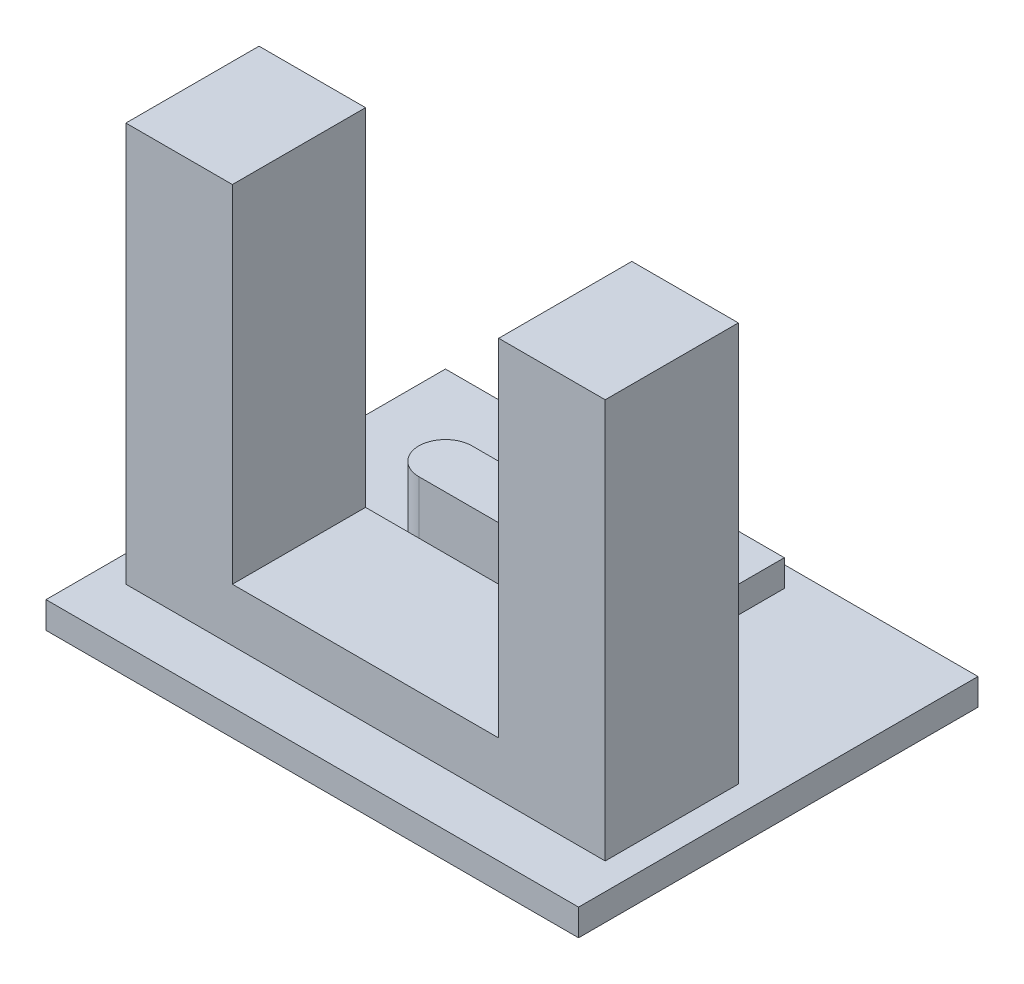
ISO-10303-21;
HEADER;
FILE_DESCRIPTION(('STEP AP214'),'2;1');
FILE_NAME('part.step','',(''),(''),'','','');
FILE_SCHEMA(('AUTOMOTIVE_DESIGN { 1 0 10303 214 1 1 1 1 }'));
ENDSEC;
DATA;
#1=APPLICATION_CONTEXT('core data for automotive mechanical design processes');
#2=APPLICATION_PROTOCOL_DEFINITION('international standard','automotive_design',2000,#1);
#3=PRODUCT_CONTEXT('',#1,'mechanical');
#4=PRODUCT('Part','Part','',(#3));
#5=PRODUCT_RELATED_PRODUCT_CATEGORY('part','',(#4));
#6=PRODUCT_DEFINITION_FORMATION('','',#4);
#7=PRODUCT_DEFINITION_CONTEXT('part definition',#1,'design');
#8=PRODUCT_DEFINITION('design','',#6,#7);
#9=PRODUCT_DEFINITION_SHAPE('','',#8);
#10=(LENGTH_UNIT() NAMED_UNIT(*) SI_UNIT(.MILLI.,.METRE.));
#11=(NAMED_UNIT(*) PLANE_ANGLE_UNIT() SI_UNIT($,.RADIAN.));
#12=(NAMED_UNIT(*) SI_UNIT($,.STERADIAN.) SOLID_ANGLE_UNIT());
#13=UNCERTAINTY_MEASURE_WITH_UNIT(LENGTH_MEASURE(1.E-05),#10,'distance_accuracy_value','');
#14=(GEOMETRIC_REPRESENTATION_CONTEXT(3) GLOBAL_UNCERTAINTY_ASSIGNED_CONTEXT((#13)) GLOBAL_UNIT_ASSIGNED_CONTEXT((#10,
#11,#12)) REPRESENTATION_CONTEXT('',''));
#15=CARTESIAN_POINT('',(0.,0.,0.));
#16=DIRECTION('',(0.,0.,1.));
#17=DIRECTION('',(1.,0.,0.));
#18=AXIS2_PLACEMENT_3D('',#15,#16,#17);
#19=CARTESIAN_POINT('',(0.,0.,0.));
#20=DIRECTION('',(0.,1.,0.));
#21=DIRECTION('',(0.,0.,1.));
#22=AXIS2_PLACEMENT_3D('',#19,#20,#21);
#23=PLANE('',#22);
#24=DIRECTION('',(0.,0.,1.));
#25=VECTOR('',#24,1.);
#26=CARTESIAN_POINT('',(-19.9031908774488,0.,0.));
#27=LINE('',#26,#25);
#28=CARTESIAN_POINT('',(-19.9031908774488,0.,-23.1784593066955));
#29=VERTEX_POINT('',#28);
#30=CARTESIAN_POINT('',(-19.9031908774488,0.,-8.1784593066955));
#31=VERTEX_POINT('',#30);
#32=EDGE_CURVE('E400',#29,#31,#27,.T.);
#33=ORIENTED_EDGE('',*,*,#32,.F.);
#34=DIRECTION('',(1.,0.,0.));
#35=VECTOR('',#34,1.);
#36=CARTESIAN_POINT('',(0.,0.,-23.1784593066955));
#37=LINE('',#36,#35);
#38=CARTESIAN_POINT('',(-39.9031908774488,0.,-23.1784593066955));
#39=VERTEX_POINT('',#38);
#40=EDGE_CURVE('E417',#39,#29,#37,.T.);
#41=ORIENTED_EDGE('',*,*,#40,.F.);
#42=DIRECTION('',(0.,0.,1.));
#43=VECTOR('',#42,1.);
#44=CARTESIAN_POINT('',(-39.9031908774488,0.,0.));
#45=LINE('',#44,#43);
#46=CARTESIAN_POINT('',(-39.9031908774488,0.,-8.1784593066955));
#47=VERTEX_POINT('',#46);
#48=EDGE_CURVE('E419',#39,#47,#45,.T.);
#49=ORIENTED_EDGE('',*,*,#48,.T.);
#50=DIRECTION('',(1.,0.,0.));
#51=VECTOR('',#50,1.);
#52=CARTESIAN_POINT('',(0.,0.,-8.1784593066955));
#53=LINE('',#52,#51);
#54=EDGE_CURVE('E406',#47,#31,#53,.T.);
#55=ORIENTED_EDGE('',*,*,#54,.T.);
#56=EDGE_LOOP('',(#33,#41,#49,#55));
#57=FACE_BOUND('',#56,.T.);
#58=DIRECTION('',(1.,0.,0.));
#59=VECTOR('',#58,1.);
#60=CARTESIAN_POINT('',(0.,0.,-15.1784593066955));
#61=LINE('',#60,#59);
#62=CARTESIAN_POINT('',(-38.9031908774488,0.,-15.1784593066955));
#63=VERTEX_POINT('',#62);
#64=CARTESIAN_POINT('',(-20.9031908774488,0.,-15.1784593066955));
#65=VERTEX_POINT('',#64);
#66=EDGE_CURVE('E387',#63,#65,#61,.T.);
#67=ORIENTED_EDGE('',*,*,#66,.T.);
#68=DIRECTION('',(0.,0.,1.));
#69=VECTOR('',#68,1.);
#70=CARTESIAN_POINT('',(-20.9031908774488,0.,0.));
#71=LINE('',#70,#69);
#72=CARTESIAN_POINT('',(-20.9031908774488,0.,-10.1784593066955));
#73=VERTEX_POINT('',#72);
#74=EDGE_CURVE('E337',#65,#73,#71,.T.);
#75=ORIENTED_EDGE('',*,*,#74,.T.);
#76=DIRECTION('',(1.,0.,0.));
#77=VECTOR('',#76,1.);
#78=CARTESIAN_POINT('',(0.,0.,-10.1784593066955));
#79=LINE('',#78,#77);
#80=CARTESIAN_POINT('',(-38.9031908774488,0.,-10.1784593066955));
#81=VERTEX_POINT('',#80);
#82=EDGE_CURVE('E392',#81,#73,#79,.T.);
#83=ORIENTED_EDGE('',*,*,#82,.F.);
#84=DIRECTION('',(0.,0.,1.));
#85=VECTOR('',#84,1.);
#86=CARTESIAN_POINT('',(-38.9031908774488,0.,0.));
#87=LINE('',#86,#85);
#88=EDGE_CURVE('E362',#63,#81,#87,.T.);
#89=ORIENTED_EDGE('',*,*,#88,.F.);
#90=EDGE_LOOP('',(#67,#75,#83,#89));
#91=FACE_BOUND('',#90,.T.);
#92=CARTESIAN_POINT('',(-25.9031908774488,0.,-17.1784593066955));
#93=DIRECTION('',(0.,1.,0.));
#94=DIRECTION('',(0.,0.,1.));
#95=AXIS2_PLACEMENT_3D('',#92,#93,#94);
#96=CIRCLE('',#95,1.);
#97=CARTESIAN_POINT('',(-25.9031908774488,0.,-18.1784593066955));
#98=VERTEX_POINT('',#97);
#99=CARTESIAN_POINT('',(-25.9031908774488,0.,-16.1784593066955));
#100=VERTEX_POINT('',#99);
#101=EDGE_CURVE('E305',#98,#100,#96,.F.);
#102=ORIENTED_EDGE('',*,*,#101,.T.);
#103=DIRECTION('',(-1.,0.,0.));
#104=VECTOR('',#103,1.);
#105=CARTESIAN_POINT('',(0.,0.,-16.1784593066955));
#106=LINE('',#105,#104);
#107=CARTESIAN_POINT('',(-33.9031908774488,0.,-16.1784593066955));
#108=VERTEX_POINT('',#107);
#109=EDGE_CURVE('E310',#100,#108,#106,.T.);
#110=ORIENTED_EDGE('',*,*,#109,.T.);
#111=CARTESIAN_POINT('',(-33.9031908774488,0.,-17.1784593066955));
#112=DIRECTION('',(0.,1.,0.));
#113=DIRECTION('',(0.,0.,1.));
#114=AXIS2_PLACEMENT_3D('',#111,#112,#113);
#115=CIRCLE('',#114,1.);
#116=CARTESIAN_POINT('',(-33.9031908774488,0.,-18.1784593066955));
#117=VERTEX_POINT('',#116);
#118=EDGE_CURVE('E322',#117,#108,#115,.T.);
#119=ORIENTED_EDGE('',*,*,#118,.F.);
#120=DIRECTION('',(1.,0.,0.));
#121=VECTOR('',#120,1.);
#122=CARTESIAN_POINT('',(0.,0.,-18.1784593066955));
#123=LINE('',#122,#121);
#124=EDGE_CURVE('E320',#117,#98,#123,.T.);
#125=ORIENTED_EDGE('',*,*,#124,.T.);
#126=EDGE_LOOP('',(#102,#110,#119,#125));
#127=FACE_BOUND('',#126,.T.);
#128=DIRECTION('',(1.,0.,0.));
#129=VECTOR('',#128,1.);
#130=CARTESIAN_POINT('',(0.,0.,-22.4055591876345));
#131=LINE('',#130,#129);
#132=CARTESIAN_POINT('',(-33.4031908774488,0.,-22.4055591876345));
#133=VERTEX_POINT('',#132);
#134=CARTESIAN_POINT('',(-26.4031908774488,0.,-22.4055591876345));
#135=VERTEX_POINT('',#134);
#136=EDGE_CURVE('E280',#133,#135,#131,.T.);
#137=ORIENTED_EDGE('',*,*,#136,.T.);
#138=DIRECTION('',(0.,0.,1.));
#139=VECTOR('',#138,1.);
#140=CARTESIAN_POINT('',(-26.4031908774488,0.,0.));
#141=LINE('',#140,#139);
#142=CARTESIAN_POINT('',(-26.4031908774488,0.,-20.4055591876345));
#143=VERTEX_POINT('',#142);
#144=EDGE_CURVE('E243',#135,#143,#141,.T.);
#145=ORIENTED_EDGE('',*,*,#144,.T.);
#146=DIRECTION('',(1.,0.,0.));
#147=VECTOR('',#146,1.);
#148=CARTESIAN_POINT('',(0.,0.,-20.4055591876345));
#149=LINE('',#148,#147);
#150=CARTESIAN_POINT('',(-33.4031908774488,0.,-20.4055591876345));
#151=VERTEX_POINT('',#150);
#152=EDGE_CURVE('E302',#151,#143,#149,.T.);
#153=ORIENTED_EDGE('',*,*,#152,.F.);
#154=DIRECTION('',(0.,0.,1.));
#155=VECTOR('',#154,1.);
#156=CARTESIAN_POINT('',(-33.4031908774488,0.,0.));
#157=LINE('',#156,#155);
#158=EDGE_CURVE('E300',#133,#151,#157,.T.);
#159=ORIENTED_EDGE('',*,*,#158,.F.);
#160=EDGE_LOOP('',(#137,#145,#153,#159));
#161=FACE_BOUND('',#160,.T.);
#162=ADVANCED_FACE('F80',(#57,#91,#127,#161),#23,.T.);
#163=CARTESIAN_POINT('',(0.,-1.,0.));
#164=DIRECTION('',(0.,1.,0.));
#165=DIRECTION('',(0.,0.,1.));
#166=AXIS2_PLACEMENT_3D('',#163,#164,#165);
#167=PLANE('',#166);
#168=DIRECTION('',(0.,0.,1.));
#169=VECTOR('',#168,1.);
#170=CARTESIAN_POINT('',(-19.9031908774488,-1.,0.));
#171=LINE('',#170,#169);
#172=CARTESIAN_POINT('',(-19.9031908774488,-1.,-23.1784593066955));
#173=VERTEX_POINT('',#172);
#174=CARTESIAN_POINT('',(-19.9031908774488,-1.,-8.1784593066955));
#175=VERTEX_POINT('',#174);
#176=EDGE_CURVE('E403',#173,#175,#171,.T.);
#177=ORIENTED_EDGE('',*,*,#176,.T.);
#178=DIRECTION('',(1.,0.,0.));
#179=VECTOR('',#178,1.);
#180=CARTESIAN_POINT('',(0.,-1.,-8.1784593066955));
#181=LINE('',#180,#179);
#182=CARTESIAN_POINT('',(-39.9031908774488,-1.,-8.1784593066955));
#183=VERTEX_POINT('',#182);
#184=EDGE_CURVE('E411',#183,#175,#181,.T.);
#185=ORIENTED_EDGE('',*,*,#184,.F.);
#186=DIRECTION('',(0.,0.,1.));
#187=VECTOR('',#186,1.);
#188=CARTESIAN_POINT('',(-39.9031908774488,-1.,0.));
#189=LINE('',#188,#187);
#190=CARTESIAN_POINT('',(-39.9031908774488,-1.,-23.1784593066955));
#191=VERTEX_POINT('',#190);
#192=EDGE_CURVE('E408',#191,#183,#189,.T.);
#193=ORIENTED_EDGE('',*,*,#192,.F.);
#194=DIRECTION('',(1.,0.,0.));
#195=VECTOR('',#194,1.);
#196=CARTESIAN_POINT('',(0.,-1.,-23.1784593066955));
#197=LINE('',#196,#195);
#198=EDGE_CURVE('E405',#191,#173,#197,.T.);
#199=ORIENTED_EDGE('',*,*,#198,.T.);
#200=EDGE_LOOP('',(#177,#185,#193,#199));
#201=FACE_BOUND('',#200,.T.);
#202=DIRECTION('',(0.,0.,1.));
#203=VECTOR('',#202,1.);
#204=CARTESIAN_POINT('',(-26.4031908774488,-1.,0.));
#205=LINE('',#204,#203);
#206=CARTESIAN_POINT('',(-26.4031908774488,-1.,-22.4055591876345));
#207=VERTEX_POINT('',#206);
#208=CARTESIAN_POINT('',(-26.4031908774488,-1.,-20.4055591876345));
#209=VERTEX_POINT('',#208);
#210=EDGE_CURVE('E12',#207,#209,#205,.T.);
#211=ORIENTED_EDGE('',*,*,#210,.F.);
#212=DIRECTION('',(1.,0.,0.));
#213=VECTOR('',#212,1.);
#214=CARTESIAN_POINT('',(0.,-1.,-22.4055591876345));
#215=LINE('',#214,#213);
#216=CARTESIAN_POINT('',(-33.4031908774488,-1.,-22.4055591876345));
#217=VERTEX_POINT('',#216);
#218=EDGE_CURVE('E426',#217,#207,#215,.T.);
#219=ORIENTED_EDGE('',*,*,#218,.F.);
#220=DIRECTION('',(0.,0.,1.));
#221=VECTOR('',#220,1.);
#222=CARTESIAN_POINT('',(-33.4031908774488,-1.,0.));
#223=LINE('',#222,#221);
#224=CARTESIAN_POINT('',(-33.4031908774488,-1.,-20.4055591876345));
#225=VERTEX_POINT('',#224);
#226=EDGE_CURVE('E435',#217,#225,#223,.T.);
#227=ORIENTED_EDGE('',*,*,#226,.T.);
#228=DIRECTION('',(1.,0.,0.));
#229=VECTOR('',#228,1.);
#230=CARTESIAN_POINT('',(0.,-1.,-20.4055591876345));
#231=LINE('',#230,#229);
#232=EDGE_CURVE('E88',#225,#209,#231,.T.);
#233=ORIENTED_EDGE('',*,*,#232,.T.);
#234=EDGE_LOOP('',(#211,#219,#227,#233));
#235=FACE_BOUND('',#234,.T.);
#236=ADVANCED_FACE('F437',(#201,#235),#167,.F.);
#237=CARTESIAN_POINT('',(0.,-1.,-8.1784593066955));
#238=DIRECTION('',(0.,0.,1.));
#239=DIRECTION('',(1.,0.,0.));
#240=AXIS2_PLACEMENT_3D('',#237,#238,#239);
#241=PLANE('',#240);
#242=ORIENTED_EDGE('',*,*,#54,.F.);
#243=DIRECTION('',(0.,1.,0.));
#244=VECTOR('',#243,1.);
#245=CARTESIAN_POINT('',(-39.9031908774488,-1.,-8.1784593066955));
#246=LINE('',#245,#244);
#247=EDGE_CURVE('E427',#183,#47,#246,.T.);
#248=ORIENTED_EDGE('',*,*,#247,.F.);
#249=ORIENTED_EDGE('',*,*,#184,.T.);
#250=DIRECTION('',(0.,1.,0.));
#251=VECTOR('',#250,1.);
#252=CARTESIAN_POINT('',(-19.9031908774488,-1.,-8.1784593066955));
#253=LINE('',#252,#251);
#254=EDGE_CURVE('E424',#175,#31,#253,.T.);
#255=ORIENTED_EDGE('',*,*,#254,.T.);
#256=EDGE_LOOP('',(#242,#248,#249,#255));
#257=FACE_BOUND('',#256,.T.);
#258=ADVANCED_FACE('F476',(#257),#241,.T.);
#259=CARTESIAN_POINT('',(-39.9031908774488,-1.,0.));
#260=DIRECTION('',(-1.,0.,0.));
#261=DIRECTION('',(0.,0.,1.));
#262=AXIS2_PLACEMENT_3D('',#259,#260,#261);
#263=PLANE('',#262);
#264=ORIENTED_EDGE('',*,*,#48,.F.);
#265=DIRECTION('',(0.,1.,0.));
#266=VECTOR('',#265,1.);
#267=CARTESIAN_POINT('',(-39.9031908774488,-1.,-23.1784593066955));
#268=LINE('',#267,#266);
#269=EDGE_CURVE('E429',#191,#39,#268,.T.);
#270=ORIENTED_EDGE('',*,*,#269,.F.);
#271=ORIENTED_EDGE('',*,*,#192,.T.);
#272=ORIENTED_EDGE('',*,*,#247,.T.);
#273=EDGE_LOOP('',(#264,#270,#271,#272));
#274=FACE_BOUND('',#273,.T.);
#275=ADVANCED_FACE('F689',(#274),#263,.T.);
#276=CARTESIAN_POINT('',(0.,-1.,-23.1784593066955));
#277=DIRECTION('',(0.,0.,1.));
#278=DIRECTION('',(1.,0.,0.));
#279=AXIS2_PLACEMENT_3D('',#276,#277,#278);
#280=PLANE('',#279);
#281=ORIENTED_EDGE('',*,*,#40,.T.);
#282=DIRECTION('',(0.,1.,0.));
#283=VECTOR('',#282,1.);
#284=CARTESIAN_POINT('',(-19.9031908774488,-1.,-23.1784593066955));
#285=LINE('',#284,#283);
#286=EDGE_CURVE('E414',#173,#29,#285,.T.);
#287=ORIENTED_EDGE('',*,*,#286,.F.);
#288=ORIENTED_EDGE('',*,*,#198,.F.);
#289=ORIENTED_EDGE('',*,*,#269,.T.);
#290=EDGE_LOOP('',(#281,#287,#288,#289));
#291=FACE_BOUND('',#290,.T.);
#292=ADVANCED_FACE('F588',(#291),#280,.F.);
#293=CARTESIAN_POINT('',(-19.9031908774488,-1.,0.));
#294=DIRECTION('',(-1.,0.,0.));
#295=DIRECTION('',(0.,0.,1.));
#296=AXIS2_PLACEMENT_3D('',#293,#294,#295);
#297=PLANE('',#296);
#298=ORIENTED_EDGE('',*,*,#32,.T.);
#299=ORIENTED_EDGE('',*,*,#254,.F.);
#300=ORIENTED_EDGE('',*,*,#176,.F.);
#301=ORIENTED_EDGE('',*,*,#286,.T.);
#302=EDGE_LOOP('',(#298,#299,#300,#301));
#303=FACE_BOUND('',#302,.T.);
#304=ADVANCED_FACE('F82',(#303),#297,.F.);
#305=CARTESIAN_POINT('',(0.,2.,-15.1784593066955));
#306=DIRECTION('',(0.,0.,-1.));
#307=DIRECTION('',(-1.,0.,0.));
#308=AXIS2_PLACEMENT_3D('',#305,#306,#307);
#309=PLANE('',#308);
#310=ORIENTED_EDGE('',*,*,#66,.F.);
#311=DIRECTION('',(0.,-1.,0.));
#312=VECTOR('',#311,1.);
#313=CARTESIAN_POINT('',(-38.9031908774488,15.,-15.1784593066955));
#314=LINE('',#313,#312);
#315=CARTESIAN_POINT('',(-38.9031908774488,15.,-15.1784593066955));
#316=VERTEX_POINT('',#315);
#317=EDGE_CURVE('E374',#316,#63,#314,.T.);
#318=ORIENTED_EDGE('',*,*,#317,.F.);
#319=DIRECTION('',(1.,0.,0.));
#320=VECTOR('',#319,1.);
#321=CARTESIAN_POINT('',(0.,15.,-15.1784593066955));
#322=LINE('',#321,#320);
#323=CARTESIAN_POINT('',(-34.9031908774488,15.,-15.1784593066955));
#324=VERTEX_POINT('',#323);
#325=EDGE_CURVE('E371',#316,#324,#322,.T.);
#326=ORIENTED_EDGE('',*,*,#325,.T.);
#327=DIRECTION('',(0.,-1.,0.));
#328=VECTOR('',#327,1.);
#329=CARTESIAN_POINT('',(-34.9031908774488,15.,-15.1784593066955));
#330=LINE('',#329,#328);
#331=CARTESIAN_POINT('',(-34.9031908774488,2.,-15.1784593066955));
#332=VERTEX_POINT('',#331);
#333=EDGE_CURVE('E379',#324,#332,#330,.T.);
#334=ORIENTED_EDGE('',*,*,#333,.T.);
#335=DIRECTION('',(1.,0.,0.));
#336=VECTOR('',#335,1.);
#337=CARTESIAN_POINT('',(0.,2.,-15.1784593066955));
#338=LINE('',#337,#336);
#339=CARTESIAN_POINT('',(-24.9031908774488,2.,-15.1784593066955));
#340=VERTEX_POINT('',#339);
#341=EDGE_CURVE('E391',#332,#340,#338,.T.);
#342=ORIENTED_EDGE('',*,*,#341,.T.);
#343=DIRECTION('',(0.,-1.,0.));
#344=VECTOR('',#343,1.);
#345=CARTESIAN_POINT('',(-24.9031908774488,15.,-15.1784593066955));
#346=LINE('',#345,#344);
#347=CARTESIAN_POINT('',(-24.9031908774488,15.,-15.1784593066955));
#348=VERTEX_POINT('',#347);
#349=EDGE_CURVE('E359',#348,#340,#346,.T.);
#350=ORIENTED_EDGE('',*,*,#349,.F.);
#351=DIRECTION('',(1.,0.,0.));
#352=VECTOR('',#351,1.);
#353=CARTESIAN_POINT('',(0.,15.,-15.1784593066955));
#354=LINE('',#353,#352);
#355=CARTESIAN_POINT('',(-20.9031908774488,15.,-15.1784593066955));
#356=VERTEX_POINT('',#355);
#357=EDGE_CURVE('E338',#348,#356,#354,.T.);
#358=ORIENTED_EDGE('',*,*,#357,.T.);
#359=DIRECTION('',(0.,-1.,0.));
#360=VECTOR('',#359,1.);
#361=CARTESIAN_POINT('',(-20.9031908774488,15.,-15.1784593066955));
#362=LINE('',#361,#360);
#363=EDGE_CURVE('E348',#356,#65,#362,.T.);
#364=ORIENTED_EDGE('',*,*,#363,.T.);
#365=EDGE_LOOP('',(#310,#318,#326,#334,#342,#350,#358,#364));
#366=FACE_BOUND('',#365,.T.);
#367=ADVANCED_FACE('F581',(#366),#309,.T.);
#368=CARTESIAN_POINT('',(0.,2.,-10.1784593066955));
#369=DIRECTION('',(0.,0.,-1.));
#370=DIRECTION('',(-1.,0.,0.));
#371=AXIS2_PLACEMENT_3D('',#368,#369,#370);
#372=PLANE('',#371);
#373=ORIENTED_EDGE('',*,*,#82,.T.);
#374=DIRECTION('',(0.,-1.,0.));
#375=VECTOR('',#374,1.);
#376=CARTESIAN_POINT('',(-20.9031908774488,15.,-10.1784593066955));
#377=LINE('',#376,#375);
#378=CARTESIAN_POINT('',(-20.9031908774488,15.,-10.1784593066955));
#379=VERTEX_POINT('',#378);
#380=EDGE_CURVE('E353',#379,#73,#377,.T.);
#381=ORIENTED_EDGE('',*,*,#380,.F.);
#382=DIRECTION('',(1.,0.,0.));
#383=VECTOR('',#382,1.);
#384=CARTESIAN_POINT('',(0.,15.,-10.1784593066955));
#385=LINE('',#384,#383);
#386=CARTESIAN_POINT('',(-24.9031908774488,15.,-10.1784593066955));
#387=VERTEX_POINT('',#386);
#388=EDGE_CURVE('E343',#387,#379,#385,.T.);
#389=ORIENTED_EDGE('',*,*,#388,.F.);
#390=DIRECTION('',(0.,-1.,0.));
#391=VECTOR('',#390,1.);
#392=CARTESIAN_POINT('',(-24.9031908774488,15.,-10.1784593066955));
#393=LINE('',#392,#391);
#394=CARTESIAN_POINT('',(-24.9031908774488,2.,-10.1784593066955));
#395=VERTEX_POINT('',#394);
#396=EDGE_CURVE('E356',#387,#395,#393,.T.);
#397=ORIENTED_EDGE('',*,*,#396,.T.);
#398=DIRECTION('',(1.,0.,0.));
#399=VECTOR('',#398,1.);
#400=CARTESIAN_POINT('',(0.,2.,-10.1784593066955));
#401=LINE('',#400,#399);
#402=CARTESIAN_POINT('',(-34.9031908774488,2.,-10.1784593066955));
#403=VERTEX_POINT('',#402);
#404=EDGE_CURVE('E398',#403,#395,#401,.T.);
#405=ORIENTED_EDGE('',*,*,#404,.F.);
#406=DIRECTION('',(0.,-1.,0.));
#407=VECTOR('',#406,1.);
#408=CARTESIAN_POINT('',(-34.9031908774488,15.,-10.1784593066955));
#409=LINE('',#408,#407);
#410=CARTESIAN_POINT('',(-34.9031908774488,15.,-10.1784593066955));
#411=VERTEX_POINT('',#410);
#412=EDGE_CURVE('E382',#411,#403,#409,.T.);
#413=ORIENTED_EDGE('',*,*,#412,.F.);
#414=DIRECTION('',(1.,0.,0.));
#415=VECTOR('',#414,1.);
#416=CARTESIAN_POINT('',(0.,15.,-10.1784593066955));
#417=LINE('',#416,#415);
#418=CARTESIAN_POINT('',(-38.9031908774488,15.,-10.1784593066955));
#419=VERTEX_POINT('',#418);
#420=EDGE_CURVE('E366',#419,#411,#417,.T.);
#421=ORIENTED_EDGE('',*,*,#420,.F.);
#422=DIRECTION('',(0.,-1.,0.));
#423=VECTOR('',#422,1.);
#424=CARTESIAN_POINT('',(-38.9031908774488,15.,-10.1784593066955));
#425=LINE('',#424,#423);
#426=EDGE_CURVE('E384',#419,#81,#425,.T.);
#427=ORIENTED_EDGE('',*,*,#426,.T.);
#428=EDGE_LOOP('',(#373,#381,#389,#397,#405,#413,#421,#427));
#429=FACE_BOUND('',#428,.T.);
#430=ADVANCED_FACE('F577',(#429),#372,.F.);
#431=CARTESIAN_POINT('',(0.,2.,0.));
#432=DIRECTION('',(0.,1.,0.));
#433=DIRECTION('',(0.,0.,1.));
#434=AXIS2_PLACEMENT_3D('',#431,#432,#433);
#435=PLANE('',#434);
#436=DIRECTION('',(0.,0.,1.));
#437=VECTOR('',#436,1.);
#438=CARTESIAN_POINT('',(-24.9031908774488,2.,0.));
#439=LINE('',#438,#437);
#440=EDGE_CURVE('E388',#340,#395,#439,.T.);
#441=ORIENTED_EDGE('',*,*,#440,.F.);
#442=ORIENTED_EDGE('',*,*,#341,.F.);
#443=DIRECTION('',(0.,0.,1.));
#444=VECTOR('',#443,1.);
#445=CARTESIAN_POINT('',(-34.9031908774488,2.,0.));
#446=LINE('',#445,#444);
#447=EDGE_CURVE('E395',#332,#403,#446,.T.);
#448=ORIENTED_EDGE('',*,*,#447,.T.);
#449=ORIENTED_EDGE('',*,*,#404,.T.);
#450=EDGE_LOOP('',(#441,#442,#448,#449));
#451=FACE_BOUND('',#450,.T.);
#452=ADVANCED_FACE('F573',(#451),#435,.T.);
#453=CARTESIAN_POINT('',(-38.9031908774488,15.,0.));
#454=DIRECTION('',(1.,0.,0.));
#455=DIRECTION('',(0.,0.,-1.));
#456=AXIS2_PLACEMENT_3D('',#453,#454,#455);
#457=PLANE('',#456);
#458=ORIENTED_EDGE('',*,*,#88,.T.);
#459=ORIENTED_EDGE('',*,*,#426,.F.);
#460=DIRECTION('',(0.,0.,1.));
#461=VECTOR('',#460,1.);
#462=CARTESIAN_POINT('',(-38.9031908774488,15.,0.));
#463=LINE('',#462,#461);
#464=EDGE_CURVE('E363',#316,#419,#463,.T.);
#465=ORIENTED_EDGE('',*,*,#464,.F.);
#466=ORIENTED_EDGE('',*,*,#317,.T.);
#467=EDGE_LOOP('',(#458,#459,#465,#466));
#468=FACE_BOUND('',#467,.T.);
#469=ADVANCED_FACE('F569',(#468),#457,.F.);
#470=CARTESIAN_POINT('',(-34.9031908774488,15.,0.));
#471=DIRECTION('',(1.,0.,0.));
#472=DIRECTION('',(0.,0.,-1.));
#473=AXIS2_PLACEMENT_3D('',#470,#471,#472);
#474=PLANE('',#473);
#475=ORIENTED_EDGE('',*,*,#412,.T.);
#476=ORIENTED_EDGE('',*,*,#447,.F.);
#477=ORIENTED_EDGE('',*,*,#333,.F.);
#478=DIRECTION('',(0.,0.,1.));
#479=VECTOR('',#478,1.);
#480=CARTESIAN_POINT('',(-34.9031908774488,15.,0.));
#481=LINE('',#480,#479);
#482=EDGE_CURVE('E368',#324,#411,#481,.T.);
#483=ORIENTED_EDGE('',*,*,#482,.T.);
#484=EDGE_LOOP('',(#475,#476,#477,#483));
#485=FACE_BOUND('',#484,.T.);
#486=ADVANCED_FACE('F565',(#485),#474,.T.);
#487=CARTESIAN_POINT('',(0.,15.,0.));
#488=DIRECTION('',(0.,1.,0.));
#489=DIRECTION('',(0.,0.,1.));
#490=AXIS2_PLACEMENT_3D('',#487,#488,#489);
#491=PLANE('',#490);
#492=ORIENTED_EDGE('',*,*,#464,.T.);
#493=ORIENTED_EDGE('',*,*,#420,.T.);
#494=ORIENTED_EDGE('',*,*,#482,.F.);
#495=ORIENTED_EDGE('',*,*,#325,.F.);
#496=EDGE_LOOP('',(#492,#493,#494,#495));
#497=FACE_BOUND('',#496,.T.);
#498=ADVANCED_FACE('F561',(#497),#491,.T.);
#499=CARTESIAN_POINT('',(-24.9031908774488,15.,0.));
#500=DIRECTION('',(1.,0.,0.));
#501=DIRECTION('',(0.,0.,-1.));
#502=AXIS2_PLACEMENT_3D('',#499,#500,#501);
#503=PLANE('',#502);
#504=ORIENTED_EDGE('',*,*,#440,.T.);
#505=ORIENTED_EDGE('',*,*,#396,.F.);
#506=DIRECTION('',(0.,0.,1.));
#507=VECTOR('',#506,1.);
#508=CARTESIAN_POINT('',(-24.9031908774488,15.,0.));
#509=LINE('',#508,#507);
#510=EDGE_CURVE('E341',#348,#387,#509,.T.);
#511=ORIENTED_EDGE('',*,*,#510,.F.);
#512=ORIENTED_EDGE('',*,*,#349,.T.);
#513=EDGE_LOOP('',(#504,#505,#511,#512));
#514=FACE_BOUND('',#513,.T.);
#515=ADVANCED_FACE('F557',(#514),#503,.F.);
#516=CARTESIAN_POINT('',(-20.9031908774488,15.,0.));
#517=DIRECTION('',(1.,0.,0.));
#518=DIRECTION('',(0.,0.,-1.));
#519=AXIS2_PLACEMENT_3D('',#516,#517,#518);
#520=PLANE('',#519);
#521=ORIENTED_EDGE('',*,*,#74,.F.);
#522=ORIENTED_EDGE('',*,*,#363,.F.);
#523=DIRECTION('',(0.,0.,1.));
#524=VECTOR('',#523,1.);
#525=CARTESIAN_POINT('',(-20.9031908774488,15.,0.));
#526=LINE('',#525,#524);
#527=EDGE_CURVE('E345',#356,#379,#526,.T.);
#528=ORIENTED_EDGE('',*,*,#527,.T.);
#529=ORIENTED_EDGE('',*,*,#380,.T.);
#530=EDGE_LOOP('',(#521,#522,#528,#529));
#531=FACE_BOUND('',#530,.T.);
#532=ADVANCED_FACE('F553',(#531),#520,.T.);
#533=CARTESIAN_POINT('',(0.,15.,0.));
#534=DIRECTION('',(0.,1.,0.));
#535=DIRECTION('',(0.,0.,1.));
#536=AXIS2_PLACEMENT_3D('',#533,#534,#535);
#537=PLANE('',#536);
#538=ORIENTED_EDGE('',*,*,#357,.F.);
#539=ORIENTED_EDGE('',*,*,#510,.T.);
#540=ORIENTED_EDGE('',*,*,#388,.T.);
#541=ORIENTED_EDGE('',*,*,#527,.F.);
#542=EDGE_LOOP('',(#538,#539,#540,#541));
#543=FACE_BOUND('',#542,.T.);
#544=ADVANCED_FACE('F549',(#543),#537,.T.);
#545=CARTESIAN_POINT('',(-25.9031908774488,3.,-17.1784593066955));
#546=DIRECTION('',(0.,-1.,0.));
#547=DIRECTION('',(0.,0.,-1.));
#548=AXIS2_PLACEMENT_3D('',#545,#546,#547);
#549=CYLINDRICAL_SURFACE('',#548,1.);
#550=ORIENTED_EDGE('',*,*,#101,.F.);
#551=DIRECTION('',(0.,-1.,0.));
#552=VECTOR('',#551,1.);
#553=CARTESIAN_POINT('',(-25.9031908774488,3.,-18.1784593066955));
#554=LINE('',#553,#552);
#555=CARTESIAN_POINT('',(-25.9031908774488,3.,-18.1784593066955));
#556=VERTEX_POINT('',#555);
#557=EDGE_CURVE('E334',#556,#98,#554,.T.);
#558=ORIENTED_EDGE('',*,*,#557,.F.);
#559=CARTESIAN_POINT('',(-25.9031908774488,3.,-17.1784593066955));
#560=DIRECTION('',(0.,1.,0.));
#561=DIRECTION('',(0.,0.,1.));
#562=AXIS2_PLACEMENT_3D('',#559,#560,#561);
#563=CIRCLE('',#562,1.);
#564=CARTESIAN_POINT('',(-25.9031908774488,3.,-16.1784593066955));
#565=VERTEX_POINT('',#564);
#566=EDGE_CURVE('E306',#556,#565,#563,.F.);
#567=ORIENTED_EDGE('',*,*,#566,.T.);
#568=DIRECTION('',(0.,-1.,0.));
#569=VECTOR('',#568,1.);
#570=CARTESIAN_POINT('',(-25.9031908774488,3.,-16.1784593066955));
#571=LINE('',#570,#569);
#572=EDGE_CURVE('E318',#565,#100,#571,.T.);
#573=ORIENTED_EDGE('',*,*,#572,.T.);
#574=EDGE_LOOP('',(#550,#558,#567,#573));
#575=FACE_BOUND('',#574,.T.);
#576=ADVANCED_FACE('F545',(#575),#549,.T.);
#577=CARTESIAN_POINT('',(0.,3.,-18.1784593066955));
#578=DIRECTION('',(0.,0.,-1.));
#579=DIRECTION('',(-1.,0.,0.));
#580=AXIS2_PLACEMENT_3D('',#577,#578,#579);
#581=PLANE('',#580);
#582=ORIENTED_EDGE('',*,*,#124,.F.);
#583=DIRECTION('',(0.,-1.,0.));
#584=VECTOR('',#583,1.);
#585=CARTESIAN_POINT('',(-33.9031908774488,3.,-18.1784593066955));
#586=LINE('',#585,#584);
#587=CARTESIAN_POINT('',(-33.9031908774488,3.,-18.1784593066955));
#588=VERTEX_POINT('',#587);
#589=EDGE_CURVE('E331',#588,#117,#586,.T.);
#590=ORIENTED_EDGE('',*,*,#589,.F.);
#591=DIRECTION('',(1.,0.,0.));
#592=VECTOR('',#591,1.);
#593=CARTESIAN_POINT('',(0.,3.,-18.1784593066955));
#594=LINE('',#593,#592);
#595=EDGE_CURVE('E309',#588,#556,#594,.T.);
#596=ORIENTED_EDGE('',*,*,#595,.T.);
#597=ORIENTED_EDGE('',*,*,#557,.T.);
#598=EDGE_LOOP('',(#582,#590,#596,#597));
#599=FACE_BOUND('',#598,.T.);
#600=ADVANCED_FACE('F541',(#599),#581,.T.);
#601=CARTESIAN_POINT('',(-33.9031908774488,3.,-17.1784593066955));
#602=DIRECTION('',(0.,-1.,0.));
#603=DIRECTION('',(0.,0.,-1.));
#604=AXIS2_PLACEMENT_3D('',#601,#602,#603);
#605=CYLINDRICAL_SURFACE('',#604,1.);
#606=ORIENTED_EDGE('',*,*,#118,.T.);
#607=DIRECTION('',(0.,-1.,0.));
#608=VECTOR('',#607,1.);
#609=CARTESIAN_POINT('',(-33.9031908774488,3.,-16.1784593066955));
#610=LINE('',#609,#608);
#611=CARTESIAN_POINT('',(-33.9031908774488,3.,-16.1784593066955));
#612=VERTEX_POINT('',#611);
#613=EDGE_CURVE('E328',#612,#108,#610,.T.);
#614=ORIENTED_EDGE('',*,*,#613,.F.);
#615=CARTESIAN_POINT('',(-33.9031908774488,3.,-17.1784593066955));
#616=DIRECTION('',(0.,1.,0.));
#617=DIRECTION('',(0.,0.,1.));
#618=AXIS2_PLACEMENT_3D('',#615,#616,#617);
#619=CIRCLE('',#618,1.);
#620=EDGE_CURVE('E313',#588,#612,#619,.T.);
#621=ORIENTED_EDGE('',*,*,#620,.F.);
#622=ORIENTED_EDGE('',*,*,#589,.T.);
#623=EDGE_LOOP('',(#606,#614,#621,#622));
#624=FACE_BOUND('',#623,.T.);
#625=ADVANCED_FACE('F537',(#624),#605,.T.);
#626=CARTESIAN_POINT('',(0.,3.,-16.1784593066955));
#627=DIRECTION('',(0.,0.,1.));
#628=DIRECTION('',(1.,0.,0.));
#629=AXIS2_PLACEMENT_3D('',#626,#627,#628);
#630=PLANE('',#629);
#631=ORIENTED_EDGE('',*,*,#109,.F.);
#632=ORIENTED_EDGE('',*,*,#572,.F.);
#633=DIRECTION('',(-1.,0.,0.));
#634=VECTOR('',#633,1.);
#635=CARTESIAN_POINT('',(0.,3.,-16.1784593066955));
#636=LINE('',#635,#634);
#637=EDGE_CURVE('E315',#565,#612,#636,.T.);
#638=ORIENTED_EDGE('',*,*,#637,.T.);
#639=ORIENTED_EDGE('',*,*,#613,.T.);
#640=EDGE_LOOP('',(#631,#632,#638,#639));
#641=FACE_BOUND('',#640,.T.);
#642=ADVANCED_FACE('F533',(#641),#630,.T.);
#643=CARTESIAN_POINT('',(0.,3.,0.));
#644=DIRECTION('',(0.,1.,0.));
#645=DIRECTION('',(0.,0.,1.));
#646=AXIS2_PLACEMENT_3D('',#643,#644,#645);
#647=PLANE('',#646);
#648=ORIENTED_EDGE('',*,*,#566,.F.);
#649=ORIENTED_EDGE('',*,*,#595,.F.);
#650=ORIENTED_EDGE('',*,*,#620,.T.);
#651=ORIENTED_EDGE('',*,*,#637,.F.);
#652=EDGE_LOOP('',(#648,#649,#650,#651));
#653=FACE_BOUND('',#652,.T.);
#654=ADVANCED_FACE('F462',(#653),#647,.T.);
#655=CARTESIAN_POINT('',(0.,-4.,0.));
#656=DIRECTION('',(0.,1.,0.));
#657=DIRECTION('',(0.,0.,1.));
#658=AXIS2_PLACEMENT_3D('',#655,#656,#657);
#659=PLANE('',#658);
#660=CARTESIAN_POINT('',(-27.9031908774488,-4.,-21.4055591876345));
#661=DIRECTION('',(0.,1.,0.));
#662=DIRECTION('',(0.,0.,1.));
#663=AXIS2_PLACEMENT_3D('',#660,#661,#662);
#664=CIRCLE('',#663,0.150000000000002);
#665=CARTESIAN_POINT('',(-27.9031908774488,-4.,-21.2555591876345));
#666=VERTEX_POINT('',#665);
#667=EDGE_CURVE('E505',#666,#666,#664,.T.);
#668=ORIENTED_EDGE('',*,*,#667,.T.);
#669=EDGE_LOOP('',(#668));
#670=FACE_BOUND('',#669,.T.);
#671=CARTESIAN_POINT('',(-29.9031908774488,-4.,-21.4055591876345));
#672=DIRECTION('',(0.,1.,0.));
#673=DIRECTION('',(0.,0.,1.));
#674=AXIS2_PLACEMENT_3D('',#671,#672,#673);
#675=CIRCLE('',#674,0.150000000000002);
#676=CARTESIAN_POINT('',(-29.9031908774488,-4.,-21.2555591876345));
#677=VERTEX_POINT('',#676);
#678=EDGE_CURVE('E981',#677,#677,#675,.T.);
#679=ORIENTED_EDGE('',*,*,#678,.T.);
#680=EDGE_LOOP('',(#679));
#681=FACE_BOUND('',#680,.T.);
#682=CARTESIAN_POINT('',(-31.9031908774488,-4.,-21.4055591876345));
#683=DIRECTION('',(0.,1.,0.));
#684=DIRECTION('',(0.,0.,1.));
#685=AXIS2_PLACEMENT_3D('',#682,#683,#684);
#686=CIRCLE('',#685,0.149999999999999);
#687=CARTESIAN_POINT('',(-31.9031908774488,-4.,-21.2555591876345));
#688=VERTEX_POINT('',#687);
#689=EDGE_CURVE('E973',#688,#688,#686,.T.);
#690=ORIENTED_EDGE('',*,*,#689,.T.);
#691=EDGE_LOOP('',(#690));
#692=FACE_BOUND('',#691,.T.);
#693=DIRECTION('',(0.,0.,1.));
#694=VECTOR('',#693,1.);
#695=CARTESIAN_POINT('',(-26.4031908774488,-4.,0.));
#696=LINE('',#695,#694);
#697=CARTESIAN_POINT('',(-26.4031908774488,-4.,-22.4055591876345));
#698=VERTEX_POINT('',#697);
#699=CARTESIAN_POINT('',(-26.4031908774488,-4.,-20.4055591876345));
#700=VERTEX_POINT('',#699);
#701=EDGE_CURVE('E268',#698,#700,#696,.T.);
#702=ORIENTED_EDGE('',*,*,#701,.T.);
#703=DIRECTION('',(1.,0.,0.));
#704=VECTOR('',#703,1.);
#705=CARTESIAN_POINT('',(0.,-4.,-20.4055591876345));
#706=LINE('',#705,#704);
#707=CARTESIAN_POINT('',(-33.4031908774488,-4.,-20.4055591876345));
#708=VERTEX_POINT('',#707);
#709=EDGE_CURVE('E246',#708,#700,#706,.T.);
#710=ORIENTED_EDGE('',*,*,#709,.F.);
#711=DIRECTION('',(0.,0.,1.));
#712=VECTOR('',#711,1.);
#713=CARTESIAN_POINT('',(-33.4031908774488,-4.,0.));
#714=LINE('',#713,#712);
#715=CARTESIAN_POINT('',(-33.4031908774488,-4.,-22.4055591876345));
#716=VERTEX_POINT('',#715);
#717=EDGE_CURVE('E272',#716,#708,#714,.T.);
#718=ORIENTED_EDGE('',*,*,#717,.F.);
#719=DIRECTION('',(1.,0.,0.));
#720=VECTOR('',#719,1.);
#721=CARTESIAN_POINT('',(0.,-4.,-22.4055591876345));
#722=LINE('',#721,#720);
#723=EDGE_CURVE('E270',#716,#698,#722,.T.);
#724=ORIENTED_EDGE('',*,*,#723,.T.);
#725=EDGE_LOOP('',(#702,#710,#718,#724));
#726=FACE_BOUND('',#725,.T.);
#727=ADVANCED_FACE('F447',(#670,#681,#692,#726),#659,.F.);
#728=CARTESIAN_POINT('',(0.,-4.,-22.4055591876345));
#729=DIRECTION('',(0.,0.,1.));
#730=DIRECTION('',(1.,0.,0.));
#731=AXIS2_PLACEMENT_3D('',#728,#729,#730);
#732=PLANE('',#731);
#733=DIRECTION('',(0.,1.,0.));
#734=VECTOR('',#733,1.);
#735=CARTESIAN_POINT('',(-33.4031908774488,-4.,-22.4055591876345));
#736=LINE('',#735,#734);
#737=EDGE_CURVE('E286',#716,#217,#736,.T.);
#738=ORIENTED_EDGE('',*,*,#737,.T.);
#739=ORIENTED_EDGE('',*,*,#218,.T.);
#740=DIRECTION('',(0.,1.,0.));
#741=VECTOR('',#740,1.);
#742=CARTESIAN_POINT('',(-26.4031908774488,-4.,-22.4055591876345));
#743=LINE('',#742,#741);
#744=EDGE_CURVE('E245',#698,#207,#743,.T.);
#745=ORIENTED_EDGE('',*,*,#744,.F.);
#746=ORIENTED_EDGE('',*,*,#723,.F.);
#747=EDGE_LOOP('',(#738,#739,#745,#746));
#748=FACE_BOUND('',#747,.T.);
#749=ADVANCED_FACE('F453',(#748),#732,.F.);
#750=CARTESIAN_POINT('',(-33.4031908774488,-4.,0.));
#751=DIRECTION('',(-1.,0.,0.));
#752=DIRECTION('',(0.,0.,1.));
#753=AXIS2_PLACEMENT_3D('',#750,#751,#752);
#754=PLANE('',#753);
#755=ORIENTED_EDGE('',*,*,#226,.F.);
#756=ORIENTED_EDGE('',*,*,#737,.F.);
#757=ORIENTED_EDGE('',*,*,#717,.T.);
#758=DIRECTION('',(0.,1.,0.));
#759=VECTOR('',#758,1.);
#760=CARTESIAN_POINT('',(-33.4031908774488,-4.,-20.4055591876345));
#761=LINE('',#760,#759);
#762=EDGE_CURVE('E282',#708,#225,#761,.T.);
#763=ORIENTED_EDGE('',*,*,#762,.T.);
#764=EDGE_LOOP('',(#755,#756,#757,#763));
#765=FACE_BOUND('',#764,.T.);
#766=ADVANCED_FACE('F442',(#765),#754,.T.);
#767=CARTESIAN_POINT('',(0.,-4.,-20.4055591876345));
#768=DIRECTION('',(0.,0.,1.));
#769=DIRECTION('',(1.,0.,0.));
#770=AXIS2_PLACEMENT_3D('',#767,#768,#769);
#771=PLANE('',#770);
#772=ORIENTED_EDGE('',*,*,#232,.F.);
#773=ORIENTED_EDGE('',*,*,#762,.F.);
#774=ORIENTED_EDGE('',*,*,#709,.T.);
#775=DIRECTION('',(0.,1.,0.));
#776=VECTOR('',#775,1.);
#777=CARTESIAN_POINT('',(-26.4031908774488,-4.,-20.4055591876345));
#778=LINE('',#777,#776);
#779=EDGE_CURVE('E277',#700,#209,#778,.T.);
#780=ORIENTED_EDGE('',*,*,#779,.T.);
#781=EDGE_LOOP('',(#772,#773,#774,#780));
#782=FACE_BOUND('',#781,.T.);
#783=ADVANCED_FACE('F440',(#782),#771,.T.);
#784=CARTESIAN_POINT('',(-26.4031908774488,-4.,0.));
#785=DIRECTION('',(-1.,0.,0.));
#786=DIRECTION('',(0.,0.,1.));
#787=AXIS2_PLACEMENT_3D('',#784,#785,#786);
#788=PLANE('',#787);
#789=ORIENTED_EDGE('',*,*,#744,.T.);
#790=ORIENTED_EDGE('',*,*,#210,.T.);
#791=ORIENTED_EDGE('',*,*,#779,.F.);
#792=ORIENTED_EDGE('',*,*,#701,.F.);
#793=EDGE_LOOP('',(#789,#790,#791,#792));
#794=FACE_BOUND('',#793,.T.);
#795=ADVANCED_FACE('F451',(#794),#788,.F.);
#796=ORIENTED_EDGE('',*,*,#144,.F.);
#797=CARTESIAN_POINT('',(-26.4031908774488,1.,-22.4055591876345));
#798=VERTEX_POINT('',#797);
#799=EDGE_CURVE('E95',#135,#798,#743,.T.);
#800=ORIENTED_EDGE('',*,*,#799,.T.);
#801=DIRECTION('',(0.,0.,1.));
#802=VECTOR('',#801,1.);
#803=CARTESIAN_POINT('',(-26.4031908774488,1.,0.));
#804=LINE('',#803,#802);
#805=CARTESIAN_POINT('',(-26.4031908774488,1.,-20.4055591876345));
#806=VERTEX_POINT('',#805);
#807=EDGE_CURVE('E241',#798,#806,#804,.T.);
#808=ORIENTED_EDGE('',*,*,#807,.T.);
#809=EDGE_CURVE('E281',#143,#806,#778,.T.);
#810=ORIENTED_EDGE('',*,*,#809,.F.);
#811=EDGE_LOOP('',(#796,#800,#808,#810));
#812=FACE_BOUND('',#811,.T.);
#813=ADVANCED_FACE('F239',(#812),#788,.F.);
#814=CARTESIAN_POINT('',(-33.4031908774488,1.,-20.4055591876345));
#815=VERTEX_POINT('',#814);
#816=EDGE_CURVE('E285',#151,#815,#761,.T.);
#817=ORIENTED_EDGE('',*,*,#816,.F.);
#818=ORIENTED_EDGE('',*,*,#152,.T.);
#819=ORIENTED_EDGE('',*,*,#809,.T.);
#820=DIRECTION('',(1.,0.,0.));
#821=VECTOR('',#820,1.);
#822=CARTESIAN_POINT('',(0.,1.,-20.4055591876345));
#823=LINE('',#822,#821);
#824=EDGE_CURVE('E255',#815,#806,#823,.T.);
#825=ORIENTED_EDGE('',*,*,#824,.F.);
#826=EDGE_LOOP('',(#817,#818,#819,#825));
#827=FACE_BOUND('',#826,.T.);
#828=ADVANCED_FACE('F527',(#827),#771,.T.);
#829=CARTESIAN_POINT('',(-33.4031908774488,1.,-22.4055591876345));
#830=VERTEX_POINT('',#829);
#831=EDGE_CURVE('E260',#133,#830,#736,.T.);
#832=ORIENTED_EDGE('',*,*,#831,.F.);
#833=ORIENTED_EDGE('',*,*,#158,.T.);
#834=ORIENTED_EDGE('',*,*,#816,.T.);
#835=DIRECTION('',(0.,0.,1.));
#836=VECTOR('',#835,1.);
#837=CARTESIAN_POINT('',(-33.4031908774488,1.,0.));
#838=LINE('',#837,#836);
#839=EDGE_CURVE('E262',#830,#815,#838,.T.);
#840=ORIENTED_EDGE('',*,*,#839,.F.);
#841=EDGE_LOOP('',(#832,#833,#834,#840));
#842=FACE_BOUND('',#841,.T.);
#843=ADVANCED_FACE('F461',(#842),#754,.T.);
#844=CARTESIAN_POINT('',(-31.9031908774488,-4.,-21.4055591876345));
#845=DIRECTION('',(0.,1.,0.));
#846=DIRECTION('',(0.,0.,1.));
#847=AXIS2_PLACEMENT_3D('',#844,#845,#846);
#848=CYLINDRICAL_SURFACE('',#847,0.149999999999999);
#849=CARTESIAN_POINT('',(-31.9031908774488,0.,-21.4055591876345));
#850=DIRECTION('',(0.,1.,0.));
#851=DIRECTION('',(0.,0.,1.));
#852=AXIS2_PLACEMENT_3D('',#849,#850,#851);
#853=CIRCLE('',#852,0.149999999999999);
#854=CARTESIAN_POINT('',(-31.9031908774488,0.,-21.2555591876345));
#855=VERTEX_POINT('',#854);
#856=EDGE_CURVE('E297',#855,#855,#853,.T.);
#857=ORIENTED_EDGE('',*,*,#856,.F.);
#858=EDGE_LOOP('',(#857));
#859=FACE_BOUND('',#858,.T.);
#860=CARTESIAN_POINT('',(-31.9031908774488,1.,-21.4055591876345));
#861=DIRECTION('',(0.,1.,0.));
#862=DIRECTION('',(0.,0.,1.));
#863=AXIS2_PLACEMENT_3D('',#860,#861,#862);
#864=CIRCLE('',#863,0.149999999999999);
#865=CARTESIAN_POINT('',(-31.9031908774488,1.,-21.2555591876345));
#866=VERTEX_POINT('',#865);
#867=EDGE_CURVE('E256',#866,#866,#864,.T.);
#868=ORIENTED_EDGE('',*,*,#867,.T.);
#869=EDGE_LOOP('',(#868));
#870=FACE_BOUND('',#869,.T.);
#871=ADVANCED_FACE('F516',(#859,#870),#848,.F.);
#872=CARTESIAN_POINT('',(-29.9031908774488,-4.,-21.4055591876345));
#873=DIRECTION('',(0.,1.,0.));
#874=DIRECTION('',(0.,0.,1.));
#875=AXIS2_PLACEMENT_3D('',#872,#873,#874);
#876=CYLINDRICAL_SURFACE('',#875,0.150000000000002);
#877=CARTESIAN_POINT('',(-29.9031908774488,0.,-21.4055591876345));
#878=DIRECTION('',(0.,1.,0.));
#879=DIRECTION('',(0.,0.,1.));
#880=AXIS2_PLACEMENT_3D('',#877,#878,#879);
#881=CIRCLE('',#880,0.150000000000002);
#882=CARTESIAN_POINT('',(-29.9031908774488,0.,-21.2555591876345));
#883=VERTEX_POINT('',#882);
#884=EDGE_CURVE('E294',#883,#883,#881,.T.);
#885=ORIENTED_EDGE('',*,*,#884,.F.);
#886=EDGE_LOOP('',(#885));
#887=FACE_BOUND('',#886,.T.);
#888=CARTESIAN_POINT('',(-29.9031908774488,1.,-21.4055591876345));
#889=DIRECTION('',(0.,1.,0.));
#890=DIRECTION('',(0.,0.,1.));
#891=AXIS2_PLACEMENT_3D('',#888,#889,#890);
#892=CIRCLE('',#891,0.150000000000002);
#893=CARTESIAN_POINT('',(-29.9031908774488,1.,-21.2555591876345));
#894=VERTEX_POINT('',#893);
#895=EDGE_CURVE('E504',#894,#894,#892,.T.);
#896=ORIENTED_EDGE('',*,*,#895,.T.);
#897=EDGE_LOOP('',(#896));
#898=FACE_BOUND('',#897,.T.);
#899=ADVANCED_FACE('F499',(#887,#898),#876,.F.);
#900=CARTESIAN_POINT('',(-27.9031908774488,-4.,-21.4055591876345));
#901=DIRECTION('',(0.,1.,0.));
#902=DIRECTION('',(0.,0.,1.));
#903=AXIS2_PLACEMENT_3D('',#900,#901,#902);
#904=CYLINDRICAL_SURFACE('',#903,0.150000000000002);
#905=CARTESIAN_POINT('',(-27.9031908774488,0.,-21.4055591876345));
#906=DIRECTION('',(0.,1.,0.));
#907=DIRECTION('',(0.,0.,1.));
#908=AXIS2_PLACEMENT_3D('',#905,#906,#907);
#909=CIRCLE('',#908,0.150000000000002);
#910=CARTESIAN_POINT('',(-27.9031908774488,0.,-21.2555591876345));
#911=VERTEX_POINT('',#910);
#912=EDGE_CURVE('E291',#911,#911,#909,.T.);
#913=ORIENTED_EDGE('',*,*,#912,.F.);
#914=EDGE_LOOP('',(#913));
#915=FACE_BOUND('',#914,.T.);
#916=CARTESIAN_POINT('',(-27.9031908774488,1.,-21.4055591876345));
#917=DIRECTION('',(0.,1.,0.));
#918=DIRECTION('',(0.,0.,1.));
#919=AXIS2_PLACEMENT_3D('',#916,#917,#918);
#920=CIRCLE('',#919,0.150000000000002);
#921=CARTESIAN_POINT('',(-27.9031908774488,1.,-21.2555591876345));
#922=VERTEX_POINT('',#921);
#923=EDGE_CURVE('E503',#922,#922,#920,.T.);
#924=ORIENTED_EDGE('',*,*,#923,.T.);
#925=EDGE_LOOP('',(#924));
#926=FACE_BOUND('',#925,.T.);
#927=ADVANCED_FACE('F467',(#915,#926),#904,.F.);
#928=ORIENTED_EDGE('',*,*,#136,.F.);
#929=ORIENTED_EDGE('',*,*,#831,.T.);
#930=DIRECTION('',(1.,0.,0.));
#931=VECTOR('',#930,1.);
#932=CARTESIAN_POINT('',(0.,1.,-22.4055591876345));
#933=LINE('',#932,#931);
#934=EDGE_CURVE('E253',#830,#798,#933,.T.);
#935=ORIENTED_EDGE('',*,*,#934,.T.);
#936=ORIENTED_EDGE('',*,*,#799,.F.);
#937=EDGE_LOOP('',(#928,#929,#935,#936));
#938=FACE_BOUND('',#937,.T.);
#939=ADVANCED_FACE('F258',(#938),#732,.F.);
#940=CARTESIAN_POINT('',(0.,1.,0.));
#941=DIRECTION('',(0.,1.,0.));
#942=DIRECTION('',(0.,0.,1.));
#943=AXIS2_PLACEMENT_3D('',#940,#941,#942);
#944=PLANE('',#943);
#945=ORIENTED_EDGE('',*,*,#923,.F.);
#946=EDGE_LOOP('',(#945));
#947=FACE_BOUND('',#946,.T.);
#948=ORIENTED_EDGE('',*,*,#895,.F.);
#949=EDGE_LOOP('',(#948));
#950=FACE_BOUND('',#949,.T.);
#951=ORIENTED_EDGE('',*,*,#867,.F.);
#952=EDGE_LOOP('',(#951));
#953=FACE_BOUND('',#952,.T.);
#954=ORIENTED_EDGE('',*,*,#807,.F.);
#955=ORIENTED_EDGE('',*,*,#934,.F.);
#956=ORIENTED_EDGE('',*,*,#839,.T.);
#957=ORIENTED_EDGE('',*,*,#824,.T.);
#958=EDGE_LOOP('',(#954,#955,#956,#957));
#959=FACE_BOUND('',#958,.T.);
#960=ADVANCED_FACE('F251',(#947,#950,#953,#959),#944,.T.);
#961=ORIENTED_EDGE('',*,*,#912,.T.);
#962=EDGE_LOOP('',(#961));
#963=FACE_BOUND('',#962,.T.);
#964=ADVANCED_FACE('F472',(#963),#23,.T.);
#965=ORIENTED_EDGE('',*,*,#884,.T.);
#966=EDGE_LOOP('',(#965));
#967=FACE_BOUND('',#966,.T.);
#968=ADVANCED_FACE('F484',(#967),#23,.T.);
#969=ORIENTED_EDGE('',*,*,#856,.T.);
#970=EDGE_LOOP('',(#969));
#971=FACE_BOUND('',#970,.T.);
#972=ADVANCED_FACE('F471',(#971),#23,.T.);
#973=CARTESIAN_POINT('',(-27.9031908774488,-8.,-21.4055591876345));
#974=DIRECTION('',(0.,1.,0.));
#975=DIRECTION('',(0.,0.,1.));
#976=AXIS2_PLACEMENT_3D('',#973,#974,#975);
#977=CYLINDRICAL_SURFACE('',#976,0.150000000000002);
#978=CARTESIAN_POINT('',(-27.9031908774488,-8.,-21.4055591876345));
#979=DIRECTION('',(0.,1.,0.));
#980=DIRECTION('',(0.,0.,1.));
#981=AXIS2_PLACEMENT_3D('',#978,#979,#980);
#982=CIRCLE('',#981,0.150000000000002);
#983=CARTESIAN_POINT('',(-27.9031908774488,-8.,-21.2555591876345));
#984=VERTEX_POINT('',#983);
#985=EDGE_CURVE('E510',#984,#984,#982,.T.);
#986=ORIENTED_EDGE('',*,*,#985,.T.);
#987=EDGE_LOOP('',(#986));
#988=FACE_BOUND('',#987,.T.);
#989=ORIENTED_EDGE('',*,*,#667,.F.);
#990=EDGE_LOOP('',(#989));
#991=FACE_BOUND('',#990,.T.);
#992=ADVANCED_FACE('F483',(#988,#991),#977,.T.);
#993=CARTESIAN_POINT('',(-27.9031908774488,-8.,-21.4055591876345));
#994=DIRECTION('',(0.,1.,0.));
#995=DIRECTION('',(0.,0.,1.));
#996=AXIS2_PLACEMENT_3D('',#993,#994,#995);
#997=PLANE('',#996);
#998=ORIENTED_EDGE('',*,*,#985,.F.);
#999=EDGE_LOOP('',(#998));
#1000=FACE_BOUND('',#999,.T.);
#1001=ADVANCED_FACE('F904',(#1000),#997,.F.);
#1002=CARTESIAN_POINT('',(-29.9031908774488,-8.,-21.4055591876345));
#1003=DIRECTION('',(0.,1.,0.));
#1004=DIRECTION('',(0.,0.,1.));
#1005=AXIS2_PLACEMENT_3D('',#1002,#1003,#1004);
#1006=CYLINDRICAL_SURFACE('',#1005,0.150000000000002);
#1007=CARTESIAN_POINT('',(-29.9031908774488,-8.,-21.4055591876345));
#1008=DIRECTION('',(0.,1.,0.));
#1009=DIRECTION('',(0.,0.,1.));
#1010=AXIS2_PLACEMENT_3D('',#1007,#1008,#1009);
#1011=CIRCLE('',#1010,0.150000000000002);
#1012=CARTESIAN_POINT('',(-29.9031908774488,-8.,-21.2555591876345));
#1013=VERTEX_POINT('',#1012);
#1014=EDGE_CURVE('E976',#1013,#1013,#1011,.T.);
#1015=ORIENTED_EDGE('',*,*,#1014,.T.);
#1016=EDGE_LOOP('',(#1015));
#1017=FACE_BOUND('',#1016,.T.);
#1018=ORIENTED_EDGE('',*,*,#678,.F.);
#1019=EDGE_LOOP('',(#1018));
#1020=FACE_BOUND('',#1019,.T.);
#1021=ADVANCED_FACE('F914',(#1017,#1020),#1006,.T.);
#1022=CARTESIAN_POINT('',(-29.9031908774488,-8.,-21.4055591876345));
#1023=DIRECTION('',(0.,1.,0.));
#1024=DIRECTION('',(0.,0.,1.));
#1025=AXIS2_PLACEMENT_3D('',#1022,#1023,#1024);
#1026=PLANE('',#1025);
#1027=ORIENTED_EDGE('',*,*,#1014,.F.);
#1028=EDGE_LOOP('',(#1027));
#1029=FACE_BOUND('',#1028,.T.);
#1030=ADVANCED_FACE('F924',(#1029),#1026,.F.);
#1031=CARTESIAN_POINT('',(-31.9031908774488,-8.,-21.4055591876345));
#1032=DIRECTION('',(0.,1.,0.));
#1033=DIRECTION('',(0.,0.,1.));
#1034=AXIS2_PLACEMENT_3D('',#1031,#1032,#1033);
#1035=CYLINDRICAL_SURFACE('',#1034,0.149999999999999);
#1036=CARTESIAN_POINT('',(-31.9031908774488,-8.,-21.4055591876345));
#1037=DIRECTION('',(0.,1.,0.));
#1038=DIRECTION('',(0.,0.,1.));
#1039=AXIS2_PLACEMENT_3D('',#1036,#1037,#1038);
#1040=CIRCLE('',#1039,0.149999999999999);
#1041=CARTESIAN_POINT('',(-31.9031908774488,-8.,-21.2555591876345));
#1042=VERTEX_POINT('',#1041);
#1043=EDGE_CURVE('E972',#1042,#1042,#1040,.T.);
#1044=ORIENTED_EDGE('',*,*,#1043,.T.);
#1045=EDGE_LOOP('',(#1044));
#1046=FACE_BOUND('',#1045,.T.);
#1047=ORIENTED_EDGE('',*,*,#689,.F.);
#1048=EDGE_LOOP('',(#1047));
#1049=FACE_BOUND('',#1048,.T.);
#1050=ADVANCED_FACE('F934',(#1046,#1049),#1035,.T.);
#1051=CARTESIAN_POINT('',(-31.9031908774488,-8.,-21.4055591876345));
#1052=DIRECTION('',(0.,1.,0.));
#1053=DIRECTION('',(0.,0.,1.));
#1054=AXIS2_PLACEMENT_3D('',#1051,#1052,#1053);
#1055=PLANE('',#1054);
#1056=ORIENTED_EDGE('',*,*,#1043,.F.);
#1057=EDGE_LOOP('',(#1056));
#1058=FACE_BOUND('',#1057,.T.);
#1059=ADVANCED_FACE('F944',(#1058),#1055,.F.);
#1060=CLOSED_SHELL('',(#162,#236,#258,#275,#292,#304,#367,#430,#452,#469,#486,#498,#515,#532,
#544,#576,#600,#625,#642,#654,#727,#749,#766,#783,#795,#813,#828,#843,#871,#899,#927,#939,#960,
#964,#968,#972,#992,#1001,#1021,#1030,#1050,#1059));
#1061=MANIFOLD_SOLID_BREP('B2',#1060);
#1062=ADVANCED_BREP_SHAPE_REPRESENTATION('',(#18,#1061),#14);
#1063=SHAPE_DEFINITION_REPRESENTATION(#9,#1062);
ENDSEC;
END-ISO-10303-21;
